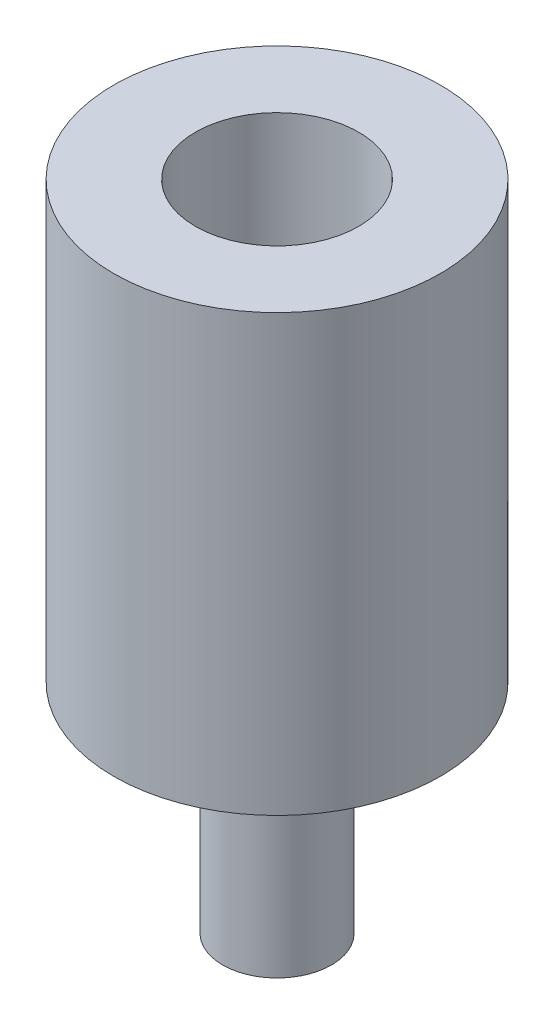
ISO-10303-21;
HEADER;
FILE_DESCRIPTION(('STEP AP214'),'2;1');
FILE_NAME('part.step','',(''),(''),'','','');
FILE_SCHEMA(('AUTOMOTIVE_DESIGN { 1 0 10303 214 1 1 1 1 }'));
ENDSEC;
DATA;
#1=APPLICATION_CONTEXT('core data for automotive mechanical design processes');
#2=APPLICATION_PROTOCOL_DEFINITION('international standard','automotive_design',2000,#1);
#3=PRODUCT_CONTEXT('',#1,'mechanical');
#4=PRODUCT('Part','Part','',(#3));
#5=PRODUCT_RELATED_PRODUCT_CATEGORY('part','',(#4));
#6=PRODUCT_DEFINITION_FORMATION('','',#4);
#7=PRODUCT_DEFINITION_CONTEXT('part definition',#1,'design');
#8=PRODUCT_DEFINITION('design','',#6,#7);
#9=PRODUCT_DEFINITION_SHAPE('','',#8);
#10=(LENGTH_UNIT() NAMED_UNIT(*) SI_UNIT(.MILLI.,.METRE.));
#11=(NAMED_UNIT(*) PLANE_ANGLE_UNIT() SI_UNIT($,.RADIAN.));
#12=(NAMED_UNIT(*) SI_UNIT($,.STERADIAN.) SOLID_ANGLE_UNIT());
#13=UNCERTAINTY_MEASURE_WITH_UNIT(LENGTH_MEASURE(1.E-05),#10,'distance_accuracy_value','');
#14=(GEOMETRIC_REPRESENTATION_CONTEXT(3) GLOBAL_UNCERTAINTY_ASSIGNED_CONTEXT((#13)) GLOBAL_UNIT_ASSIGNED_CONTEXT((#10,
#11,#12)) REPRESENTATION_CONTEXT('',''));
#15=CARTESIAN_POINT('',(0.,0.,0.));
#16=DIRECTION('',(0.,0.,1.));
#17=DIRECTION('',(1.,0.,0.));
#18=AXIS2_PLACEMENT_3D('',#15,#16,#17);
#19=CARTESIAN_POINT('',(0.,10.,0.));
#20=DIRECTION('',(0.,-1.,0.));
#21=DIRECTION('',(0.,0.,-1.));
#22=AXIS2_PLACEMENT_3D('',#19,#20,#21);
#23=CYLINDRICAL_SURFACE('',#22,2.5);
#24=CARTESIAN_POINT('',(0.,10.,0.));
#25=DIRECTION('',(0.,1.,0.));
#26=DIRECTION('',(0.,0.,1.));
#27=AXIS2_PLACEMENT_3D('',#24,#25,#26);
#28=CIRCLE('',#27,2.5);
#29=CARTESIAN_POINT('',(0.,10.,2.5));
#30=VERTEX_POINT('',#29);
#31=EDGE_CURVE('E10',#30,#30,#28,.T.);
#32=ORIENTED_EDGE('',*,*,#31,.F.);
#33=EDGE_LOOP('',(#32));
#34=FACE_BOUND('',#33,.T.);
#35=CARTESIAN_POINT('',(0.,0.,0.));
#36=DIRECTION('',(0.,1.,0.));
#37=DIRECTION('',(0.,0.,1.));
#38=AXIS2_PLACEMENT_3D('',#35,#36,#37);
#39=CIRCLE('',#38,2.5);
#40=CARTESIAN_POINT('',(0.,0.,2.5));
#41=VERTEX_POINT('',#40);
#42=EDGE_CURVE('E36',#41,#41,#39,.T.);
#43=ORIENTED_EDGE('',*,*,#42,.T.);
#44=EDGE_LOOP('',(#43));
#45=FACE_BOUND('',#44,.T.);
#46=ADVANCED_FACE('F33',(#34,#45),#23,.T.);
#47=CARTESIAN_POINT('',(0.,0.,0.));
#48=DIRECTION('',(0.,1.,0.));
#49=DIRECTION('',(0.,0.,1.));
#50=AXIS2_PLACEMENT_3D('',#47,#48,#49);
#51=PLANE('',#50);
#52=ORIENTED_EDGE('',*,*,#42,.F.);
#53=EDGE_LOOP('',(#52));
#54=FACE_BOUND('',#53,.T.);
#55=ADVANCED_FACE('F79',(#54),#51,.F.);
#56=CARTESIAN_POINT('',(0.,10.,0.));
#57=DIRECTION('',(0.,1.,0.));
#58=DIRECTION('',(0.,0.,1.));
#59=AXIS2_PLACEMENT_3D('',#56,#57,#58);
#60=PLANE('',#59);
#61=CARTESIAN_POINT('',(0.,10.,0.));
#62=DIRECTION('',(0.,1.,0.));
#63=DIRECTION('',(0.,0.,1.));
#64=AXIS2_PLACEMENT_3D('',#61,#62,#63);
#65=CIRCLE('',#64,7.5);
#66=CARTESIAN_POINT('',(0.,10.,7.5));
#67=VERTEX_POINT('',#66);
#68=EDGE_CURVE('E45',#67,#67,#65,.T.);
#69=ORIENTED_EDGE('',*,*,#68,.F.);
#70=EDGE_LOOP('',(#69));
#71=FACE_BOUND('',#70,.T.);
#72=ORIENTED_EDGE('',*,*,#31,.T.);
#73=EDGE_LOOP('',(#72));
#74=FACE_BOUND('',#73,.T.);
#75=ADVANCED_FACE('F74',(#71,#74),#60,.F.);
#76=CARTESIAN_POINT('',(0.,30.,0.));
#77=DIRECTION('',(0.,-1.,0.));
#78=DIRECTION('',(0.,0.,-1.));
#79=AXIS2_PLACEMENT_3D('',#76,#77,#78);
#80=CYLINDRICAL_SURFACE('',#79,7.5);
#81=CARTESIAN_POINT('',(0.,30.,0.));
#82=DIRECTION('',(0.,1.,0.));
#83=DIRECTION('',(0.,0.,1.));
#84=AXIS2_PLACEMENT_3D('',#81,#82,#83);
#85=CIRCLE('',#84,7.5);
#86=CARTESIAN_POINT('',(0.,30.,7.5));
#87=VERTEX_POINT('',#86);
#88=EDGE_CURVE('E43',#87,#87,#85,.T.);
#89=ORIENTED_EDGE('',*,*,#88,.F.);
#90=EDGE_LOOP('',(#89));
#91=FACE_BOUND('',#90,.T.);
#92=ORIENTED_EDGE('',*,*,#68,.T.);
#93=EDGE_LOOP('',(#92));
#94=FACE_BOUND('',#93,.T.);
#95=ADVANCED_FACE('F68',(#91,#94),#80,.T.);
#96=CARTESIAN_POINT('',(0.,30.,0.));
#97=DIRECTION('',(0.,1.,0.));
#98=DIRECTION('',(0.,0.,1.));
#99=AXIS2_PLACEMENT_3D('',#96,#97,#98);
#100=PLANE('',#99);
#101=CARTESIAN_POINT('',(0.,30.,0.));
#102=DIRECTION('',(0.,1.,0.));
#103=DIRECTION('',(0.,0.,1.));
#104=AXIS2_PLACEMENT_3D('',#101,#102,#103);
#105=CIRCLE('',#104,3.75);
#106=CARTESIAN_POINT('',(0.,30.,3.75));
#107=VERTEX_POINT('',#106);
#108=EDGE_CURVE('E51',#107,#107,#105,.T.);
#109=ORIENTED_EDGE('',*,*,#108,.F.);
#110=EDGE_LOOP('',(#109));
#111=FACE_BOUND('',#110,.T.);
#112=ORIENTED_EDGE('',*,*,#88,.T.);
#113=EDGE_LOOP('',(#112));
#114=FACE_BOUND('',#113,.T.);
#115=ADVANCED_FACE('F62',(#111,#114),#100,.T.);
#116=CARTESIAN_POINT('',(0.,16.,0.));
#117=DIRECTION('',(0.,1.,0.));
#118=DIRECTION('',(0.,0.,1.));
#119=AXIS2_PLACEMENT_3D('',#116,#117,#118);
#120=CYLINDRICAL_SURFACE('',#119,3.75);
#121=CARTESIAN_POINT('',(0.,16.,0.));
#122=DIRECTION('',(0.,1.,0.));
#123=DIRECTION('',(0.,0.,1.));
#124=AXIS2_PLACEMENT_3D('',#121,#122,#123);
#125=CIRCLE('',#124,3.75);
#126=CARTESIAN_POINT('',(0.,16.,3.75));
#127=VERTEX_POINT('',#126);
#128=EDGE_CURVE('E48',#127,#127,#125,.T.);
#129=ORIENTED_EDGE('',*,*,#128,.F.);
#130=EDGE_LOOP('',(#129));
#131=FACE_BOUND('',#130,.T.);
#132=ORIENTED_EDGE('',*,*,#108,.T.);
#133=EDGE_LOOP('',(#132));
#134=FACE_BOUND('',#133,.T.);
#135=ADVANCED_FACE('F59',(#131,#134),#120,.F.);
#136=CARTESIAN_POINT('',(0.,16.,0.));
#137=DIRECTION('',(0.,1.,0.));
#138=DIRECTION('',(0.,0.,1.));
#139=AXIS2_PLACEMENT_3D('',#136,#137,#138);
#140=PLANE('',#139);
#141=ORIENTED_EDGE('',*,*,#128,.T.);
#142=EDGE_LOOP('',(#141));
#143=FACE_BOUND('',#142,.T.);
#144=ADVANCED_FACE('F57',(#143),#140,.T.);
#145=CLOSED_SHELL('',(#46,#55,#75,#95,#115,#135,#144));
#146=MANIFOLD_SOLID_BREP('B2',#145);
#147=ADVANCED_BREP_SHAPE_REPRESENTATION('',(#18,#146),#14);
#148=SHAPE_DEFINITION_REPRESENTATION(#9,#147);
ENDSEC;
END-ISO-10303-21;
